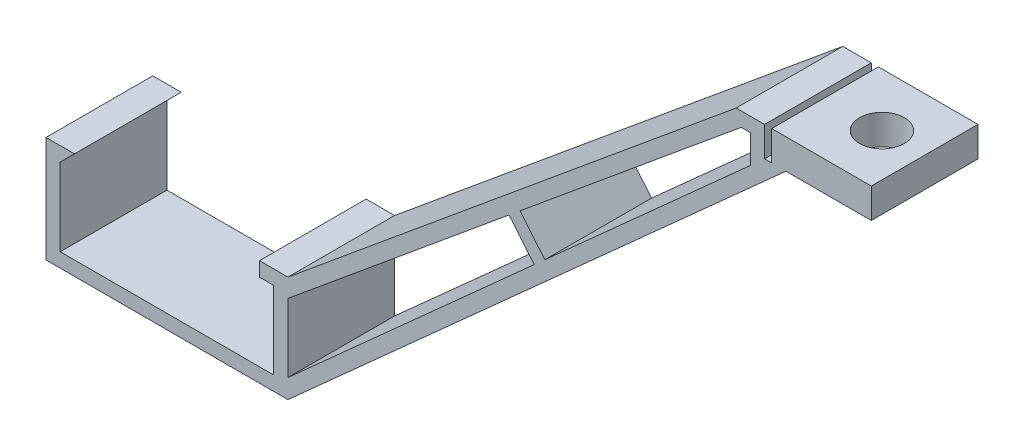
ISO-10303-21;
HEADER;
FILE_DESCRIPTION(('STEP AP214'),'2;1');
FILE_NAME('part.step','',(''),(''),'','','');
FILE_SCHEMA(('AUTOMOTIVE_DESIGN { 1 0 10303 214 1 1 1 1 }'));
ENDSEC;
DATA;
#1=APPLICATION_CONTEXT('core data for automotive mechanical design processes');
#2=APPLICATION_PROTOCOL_DEFINITION('international standard','automotive_design',2000,#1);
#3=PRODUCT_CONTEXT('',#1,'mechanical');
#4=PRODUCT('Part','Part','',(#3));
#5=PRODUCT_RELATED_PRODUCT_CATEGORY('part','',(#4));
#6=PRODUCT_DEFINITION_FORMATION('','',#4);
#7=PRODUCT_DEFINITION_CONTEXT('part definition',#1,'design');
#8=PRODUCT_DEFINITION('design','',#6,#7);
#9=PRODUCT_DEFINITION_SHAPE('','',#8);
#10=(LENGTH_UNIT() NAMED_UNIT(*) SI_UNIT(.MILLI.,.METRE.));
#11=(NAMED_UNIT(*) PLANE_ANGLE_UNIT() SI_UNIT($,.RADIAN.));
#12=(NAMED_UNIT(*) SI_UNIT($,.STERADIAN.) SOLID_ANGLE_UNIT());
#13=UNCERTAINTY_MEASURE_WITH_UNIT(LENGTH_MEASURE(1.E-05),#10,'distance_accuracy_value','');
#14=(GEOMETRIC_REPRESENTATION_CONTEXT(3) GLOBAL_UNCERTAINTY_ASSIGNED_CONTEXT((#13)) GLOBAL_UNIT_ASSIGNED_CONTEXT((#10,
#11,#12)) REPRESENTATION_CONTEXT('',''));
#15=CARTESIAN_POINT('',(0.,0.,0.));
#16=DIRECTION('',(0.,0.,1.));
#17=DIRECTION('',(1.,0.,0.));
#18=AXIS2_PLACEMENT_3D('',#15,#16,#17);
#19=CARTESIAN_POINT('',(15.,-15.,15.));
#20=DIRECTION('',(0.,-1.,0.));
#21=DIRECTION('',(1.,0.,0.));
#22=AXIS2_PLACEMENT_3D('',#19,#20,#21);
#23=PLANE('',#22);
#24=DIRECTION('',(-1.,0.,0.));
#25=VECTOR('',#24,1.);
#26=CARTESIAN_POINT('',(15.,-15.,0.));
#27=LINE('',#26,#25);
#28=CARTESIAN_POINT('',(15.,-15.,0.));
#29=VERTEX_POINT('',#28);
#30=CARTESIAN_POINT('',(-15.,-15.,0.));
#31=VERTEX_POINT('',#30);
#32=EDGE_CURVE('E271',#29,#31,#27,.T.);
#33=ORIENTED_EDGE('',*,*,#32,.T.);
#34=DIRECTION('',(0.,0.,-1.));
#35=VECTOR('',#34,1.);
#36=CARTESIAN_POINT('',(-15.,-15.,15.));
#37=LINE('',#36,#35);
#38=CARTESIAN_POINT('',(-15.,-15.,15.));
#39=VERTEX_POINT('',#38);
#40=EDGE_CURVE('E11',#39,#31,#37,.T.);
#41=ORIENTED_EDGE('',*,*,#40,.F.);
#42=DIRECTION('',(-1.,0.,0.));
#43=VECTOR('',#42,1.);
#44=CARTESIAN_POINT('',(15.,-15.,15.));
#45=LINE('',#44,#43);
#46=CARTESIAN_POINT('',(15.,-15.,15.));
#47=VERTEX_POINT('',#46);
#48=EDGE_CURVE('E360',#47,#39,#45,.T.);
#49=ORIENTED_EDGE('',*,*,#48,.F.);
#50=DIRECTION('',(0.,0.,-1.));
#51=VECTOR('',#50,1.);
#52=CARTESIAN_POINT('',(15.,-15.,15.));
#53=LINE('',#52,#51);
#54=EDGE_CURVE('E383',#47,#29,#53,.T.);
#55=ORIENTED_EDGE('',*,*,#54,.T.);
#56=EDGE_LOOP('',(#33,#41,#49,#55));
#57=FACE_BOUND('',#56,.T.);
#58=ADVANCED_FACE('F32',(#57),#23,.F.);
#59=CARTESIAN_POINT('',(-15.,-15.,15.));
#60=DIRECTION('',(-1.,0.,0.));
#61=DIRECTION('',(0.,0.,1.));
#62=AXIS2_PLACEMENT_3D('',#59,#60,#61);
#63=PLANE('',#62);
#64=DIRECTION('',(0.,1.,0.));
#65=VECTOR('',#64,1.);
#66=CARTESIAN_POINT('',(-15.,-15.,0.));
#67=LINE('',#66,#65);
#68=CARTESIAN_POINT('',(-15.,-4.08500000000001,0.));
#69=VERTEX_POINT('',#68);
#70=EDGE_CURVE('E386',#31,#69,#67,.T.);
#71=ORIENTED_EDGE('',*,*,#70,.T.);
#72=DIRECTION('',(0.,0.,-1.));
#73=VECTOR('',#72,1.);
#74=CARTESIAN_POINT('',(-15.,-4.08500000000001,15.));
#75=LINE('',#74,#73);
#76=CARTESIAN_POINT('',(-15.,-4.08500000000001,15.));
#77=VERTEX_POINT('',#76);
#78=EDGE_CURVE('E39',#77,#69,#75,.T.);
#79=ORIENTED_EDGE('',*,*,#78,.F.);
#80=DIRECTION('',(0.,1.,0.));
#81=VECTOR('',#80,1.);
#82=CARTESIAN_POINT('',(-15.,-15.,15.));
#83=LINE('',#82,#81);
#84=EDGE_CURVE('E363',#39,#77,#83,.T.);
#85=ORIENTED_EDGE('',*,*,#84,.F.);
#86=ORIENTED_EDGE('',*,*,#40,.T.);
#87=EDGE_LOOP('',(#71,#79,#85,#86));
#88=FACE_BOUND('',#87,.T.);
#89=ADVANCED_FACE('F456',(#88),#63,.F.);
#90=CARTESIAN_POINT('',(-15.,-4.08500000000001,15.));
#91=DIRECTION('',(-0.707106781186548,0.707106781186547,0.));
#92=DIRECTION('',(-0.707106781186547,-0.707106781186548,0.));
#93=AXIS2_PLACEMENT_3D('',#90,#91,#92);
#94=PLANE('',#93);
#95=DIRECTION('',(0.707106781186547,0.707106781186548,0.));
#96=VECTOR('',#95,1.);
#97=CARTESIAN_POINT('',(-15.,-4.08500000000001,0.));
#98=LINE('',#97,#96);
#99=CARTESIAN_POINT('',(-13.,-2.085,0.));
#100=VERTEX_POINT('',#99);
#101=EDGE_CURVE('E388',#69,#100,#98,.T.);
#102=ORIENTED_EDGE('',*,*,#101,.T.);
#103=DIRECTION('',(0.,0.,-1.));
#104=VECTOR('',#103,1.);
#105=CARTESIAN_POINT('',(-13.,-2.085,15.));
#106=LINE('',#105,#104);
#107=CARTESIAN_POINT('',(-13.,-2.085,15.));
#108=VERTEX_POINT('',#107);
#109=EDGE_CURVE('E428',#108,#100,#106,.T.);
#110=ORIENTED_EDGE('',*,*,#109,.F.);
#111=DIRECTION('',(0.707106781186547,0.707106781186548,0.));
#112=VECTOR('',#111,1.);
#113=CARTESIAN_POINT('',(-15.,-4.08500000000001,15.));
#114=LINE('',#113,#112);
#115=EDGE_CURVE('E366',#77,#108,#114,.T.);
#116=ORIENTED_EDGE('',*,*,#115,.F.);
#117=ORIENTED_EDGE('',*,*,#78,.T.);
#118=EDGE_LOOP('',(#102,#110,#116,#117));
#119=FACE_BOUND('',#118,.T.);
#120=ADVANCED_FACE('F435',(#119),#94,.F.);
#121=CARTESIAN_POINT('',(-17.,-2.085,15.));
#122=DIRECTION('',(0.,-1.,0.));
#123=DIRECTION('',(1.,0.,0.));
#124=AXIS2_PLACEMENT_3D('',#121,#122,#123);
#125=PLANE('',#124);
#126=DIRECTION('',(-1.,0.,0.));
#127=VECTOR('',#126,1.);
#128=CARTESIAN_POINT('',(-17.,-2.085,0.));
#129=LINE('',#128,#127);
#130=CARTESIAN_POINT('',(-17.,-2.085,0.));
#131=VERTEX_POINT('',#130);
#132=EDGE_CURVE('E390',#100,#131,#129,.T.);
#133=ORIENTED_EDGE('',*,*,#132,.T.);
#134=DIRECTION('',(0.,0.,-1.));
#135=VECTOR('',#134,1.);
#136=CARTESIAN_POINT('',(-17.,-2.085,15.));
#137=LINE('',#136,#135);
#138=CARTESIAN_POINT('',(-17.,-2.085,15.));
#139=VERTEX_POINT('',#138);
#140=EDGE_CURVE('E425',#139,#131,#137,.T.);
#141=ORIENTED_EDGE('',*,*,#140,.F.);
#142=DIRECTION('',(-1.,0.,0.));
#143=VECTOR('',#142,1.);
#144=CARTESIAN_POINT('',(-17.,-2.085,15.));
#145=LINE('',#144,#143);
#146=EDGE_CURVE('E368',#108,#139,#145,.T.);
#147=ORIENTED_EDGE('',*,*,#146,.F.);
#148=ORIENTED_EDGE('',*,*,#109,.T.);
#149=EDGE_LOOP('',(#133,#141,#147,#148));
#150=FACE_BOUND('',#149,.T.);
#151=ADVANCED_FACE('F443',(#150),#125,.F.);
#152=CARTESIAN_POINT('',(-17.,-17.,15.));
#153=DIRECTION('',(1.,0.,0.));
#154=DIRECTION('',(0.,0.,-1.));
#155=AXIS2_PLACEMENT_3D('',#152,#153,#154);
#156=PLANE('',#155);
#157=DIRECTION('',(0.,-1.,0.));
#158=VECTOR('',#157,1.);
#159=CARTESIAN_POINT('',(-17.,-17.,0.));
#160=LINE('',#159,#158);
#161=CARTESIAN_POINT('',(-17.,-17.,0.));
#162=VERTEX_POINT('',#161);
#163=EDGE_CURVE('E392',#131,#162,#160,.T.);
#164=ORIENTED_EDGE('',*,*,#163,.T.);
#165=DIRECTION('',(0.,0.,-1.));
#166=VECTOR('',#165,1.);
#167=CARTESIAN_POINT('',(-17.,-17.,15.));
#168=LINE('',#167,#166);
#169=CARTESIAN_POINT('',(-17.,-17.,15.));
#170=VERTEX_POINT('',#169);
#171=EDGE_CURVE('E422',#170,#162,#168,.T.);
#172=ORIENTED_EDGE('',*,*,#171,.F.);
#173=DIRECTION('',(0.,-1.,0.));
#174=VECTOR('',#173,1.);
#175=CARTESIAN_POINT('',(-17.,-17.,15.));
#176=LINE('',#175,#174);
#177=EDGE_CURVE('E370',#139,#170,#176,.T.);
#178=ORIENTED_EDGE('',*,*,#177,.F.);
#179=ORIENTED_EDGE('',*,*,#140,.T.);
#180=EDGE_LOOP('',(#164,#172,#178,#179));
#181=FACE_BOUND('',#180,.T.);
#182=ADVANCED_FACE('F447',(#181),#156,.F.);
#183=CARTESIAN_POINT('',(17.,-17.,15.));
#184=DIRECTION('',(0.,1.,0.));
#185=DIRECTION('',(-1.,0.,0.));
#186=AXIS2_PLACEMENT_3D('',#183,#184,#185);
#187=PLANE('',#186);
#188=DIRECTION('',(1.,0.,0.));
#189=VECTOR('',#188,1.);
#190=CARTESIAN_POINT('',(17.,-17.,0.));
#191=LINE('',#190,#189);
#192=CARTESIAN_POINT('',(17.,-17.,0.));
#193=VERTEX_POINT('',#192);
#194=EDGE_CURVE('E394',#162,#193,#191,.T.);
#195=ORIENTED_EDGE('',*,*,#194,.T.);
#196=DIRECTION('',(0.,0.,-1.));
#197=VECTOR('',#196,1.);
#198=CARTESIAN_POINT('',(17.,-17.,15.));
#199=LINE('',#198,#197);
#200=CARTESIAN_POINT('',(17.,-17.,15.));
#201=VERTEX_POINT('',#200);
#202=EDGE_CURVE('E419',#201,#193,#199,.T.);
#203=ORIENTED_EDGE('',*,*,#202,.F.);
#204=DIRECTION('',(1.,0.,0.));
#205=VECTOR('',#204,1.);
#206=CARTESIAN_POINT('',(17.,-17.,15.));
#207=LINE('',#206,#205);
#208=EDGE_CURVE('E372',#170,#201,#207,.T.);
#209=ORIENTED_EDGE('',*,*,#208,.F.);
#210=ORIENTED_EDGE('',*,*,#171,.T.);
#211=EDGE_LOOP('',(#195,#203,#209,#210));
#212=FACE_BOUND('',#211,.T.);
#213=ADVANCED_FACE('F537',(#212),#187,.F.);
#214=CARTESIAN_POINT('',(17.,-17.,15.));
#215=DIRECTION('',(-1.,0.,0.));
#216=DIRECTION('',(0.,0.,1.));
#217=AXIS2_PLACEMENT_3D('',#214,#215,#216);
#218=PLANE('',#217);
#219=DIRECTION('',(0.,1.,0.));
#220=VECTOR('',#219,1.);
#221=CARTESIAN_POINT('',(17.,-17.,15.));
#222=LINE('',#221,#220);
#223=CARTESIAN_POINT('',(17.,-14.3130944891028,15.));
#224=VERTEX_POINT('',#223);
#225=CARTESIAN_POINT('',(17.,-4.68000212023637,15.));
#226=VERTEX_POINT('',#225);
#227=EDGE_CURVE('E50',#224,#226,#222,.T.);
#228=ORIENTED_EDGE('',*,*,#227,.F.);
#229=DIRECTION('',(0.,0.,-1.));
#230=VECTOR('',#229,1.);
#231=CARTESIAN_POINT('',(17.,-14.3130944891028,111.896852374058));
#232=LINE('',#231,#230);
#233=CARTESIAN_POINT('',(17.,-14.3130944891028,0.));
#234=VERTEX_POINT('',#233);
#235=EDGE_CURVE('E347',#224,#234,#232,.T.);
#236=ORIENTED_EDGE('',*,*,#235,.T.);
#237=DIRECTION('',(0.,1.,0.));
#238=VECTOR('',#237,1.);
#239=CARTESIAN_POINT('',(17.,-17.,0.));
#240=LINE('',#239,#238);
#241=CARTESIAN_POINT('',(17.,-4.68000212023637,0.));
#242=VERTEX_POINT('',#241);
#243=EDGE_CURVE('E396',#234,#242,#240,.T.);
#244=ORIENTED_EDGE('',*,*,#243,.T.);
#245=DIRECTION('',(0.,0.,-1.));
#246=VECTOR('',#245,1.);
#247=CARTESIAN_POINT('',(17.,-4.68000212023637,111.896852374058));
#248=LINE('',#247,#246);
#249=EDGE_CURVE('E46',#226,#242,#248,.T.);
#250=ORIENTED_EDGE('',*,*,#249,.F.);
#251=EDGE_LOOP('',(#228,#236,#244,#250));
#252=FACE_BOUND('',#251,.T.);
#253=ADVANCED_FACE('F540',(#252),#218,.F.);
#254=CARTESIAN_POINT('',(17.,-2.085,15.));
#255=DIRECTION('',(0.,-1.,0.));
#256=DIRECTION('',(0.,0.,-1.));
#257=AXIS2_PLACEMENT_3D('',#254,#255,#256);
#258=PLANE('',#257);
#259=DIRECTION('',(-1.,0.,0.));
#260=VECTOR('',#259,1.);
#261=CARTESIAN_POINT('',(17.,-2.085,0.));
#262=LINE('',#261,#260);
#263=CARTESIAN_POINT('',(17.,-2.085,0.));
#264=VERTEX_POINT('',#263);
#265=CARTESIAN_POINT('',(13.,-2.085,0.));
#266=VERTEX_POINT('',#265);
#267=EDGE_CURVE('E398',#264,#266,#262,.T.);
#268=ORIENTED_EDGE('',*,*,#267,.T.);
#269=DIRECTION('',(0.,0.,-1.));
#270=VECTOR('',#269,1.);
#271=CARTESIAN_POINT('',(13.,-2.085,15.));
#272=LINE('',#271,#270);
#273=CARTESIAN_POINT('',(13.,-2.085,15.));
#274=VERTEX_POINT('',#273);
#275=EDGE_CURVE('E413',#274,#266,#272,.T.);
#276=ORIENTED_EDGE('',*,*,#275,.F.);
#277=DIRECTION('',(-1.,0.,0.));
#278=VECTOR('',#277,1.);
#279=CARTESIAN_POINT('',(17.,-2.085,15.));
#280=LINE('',#279,#278);
#281=CARTESIAN_POINT('',(17.,-2.085,15.));
#282=VERTEX_POINT('',#281);
#283=EDGE_CURVE('E375',#282,#274,#280,.T.);
#284=ORIENTED_EDGE('',*,*,#283,.F.);
#285=DIRECTION('',(0.,0.,-1.));
#286=VECTOR('',#285,1.);
#287=CARTESIAN_POINT('',(17.,-2.085,15.));
#288=LINE('',#287,#286);
#289=EDGE_CURVE('E416',#282,#264,#288,.T.);
#290=ORIENTED_EDGE('',*,*,#289,.T.);
#291=EDGE_LOOP('',(#268,#276,#284,#290));
#292=FACE_BOUND('',#291,.T.);
#293=ADVANCED_FACE('F477',(#292),#258,.F.);
#294=CARTESIAN_POINT('',(13.,-2.085,15.));
#295=DIRECTION('',(1.,0.,0.));
#296=DIRECTION('',(0.,0.,-1.));
#297=AXIS2_PLACEMENT_3D('',#294,#295,#296);
#298=PLANE('',#297);
#299=DIRECTION('',(0.,-1.,0.));
#300=VECTOR('',#299,1.);
#301=CARTESIAN_POINT('',(13.,-2.085,0.));
#302=LINE('',#301,#300);
#303=CARTESIAN_POINT('',(13.,-4.085,0.));
#304=VERTEX_POINT('',#303);
#305=EDGE_CURVE('E400',#266,#304,#302,.T.);
#306=ORIENTED_EDGE('',*,*,#305,.T.);
#307=DIRECTION('',(0.,0.,-1.));
#308=VECTOR('',#307,1.);
#309=CARTESIAN_POINT('',(13.,-4.085,15.));
#310=LINE('',#309,#308);
#311=CARTESIAN_POINT('',(13.,-4.085,15.));
#312=VERTEX_POINT('',#311);
#313=EDGE_CURVE('E410',#312,#304,#310,.T.);
#314=ORIENTED_EDGE('',*,*,#313,.F.);
#315=DIRECTION('',(0.,-1.,0.));
#316=VECTOR('',#315,1.);
#317=CARTESIAN_POINT('',(13.,-2.085,15.));
#318=LINE('',#317,#316);
#319=EDGE_CURVE('E377',#274,#312,#318,.T.);
#320=ORIENTED_EDGE('',*,*,#319,.F.);
#321=ORIENTED_EDGE('',*,*,#275,.T.);
#322=EDGE_LOOP('',(#306,#314,#320,#321));
#323=FACE_BOUND('',#322,.T.);
#324=ADVANCED_FACE('F472',(#323),#298,.F.);
#325=CARTESIAN_POINT('',(15.,-4.085,15.));
#326=DIRECTION('',(0.,1.,0.));
#327=DIRECTION('',(0.,0.,1.));
#328=AXIS2_PLACEMENT_3D('',#325,#326,#327);
#329=PLANE('',#328);
#330=DIRECTION('',(1.,0.,0.));
#331=VECTOR('',#330,1.);
#332=CARTESIAN_POINT('',(15.,-4.085,0.));
#333=LINE('',#332,#331);
#334=CARTESIAN_POINT('',(15.,-4.085,0.));
#335=VERTEX_POINT('',#334);
#336=EDGE_CURVE('E402',#304,#335,#333,.T.);
#337=ORIENTED_EDGE('',*,*,#336,.T.);
#338=DIRECTION('',(0.,0.,-1.));
#339=VECTOR('',#338,1.);
#340=CARTESIAN_POINT('',(15.,-4.085,15.));
#341=LINE('',#340,#339);
#342=CARTESIAN_POINT('',(15.,-4.085,15.));
#343=VERTEX_POINT('',#342);
#344=EDGE_CURVE('E407',#343,#335,#341,.T.);
#345=ORIENTED_EDGE('',*,*,#344,.F.);
#346=DIRECTION('',(1.,0.,0.));
#347=VECTOR('',#346,1.);
#348=CARTESIAN_POINT('',(15.,-4.085,15.));
#349=LINE('',#348,#347);
#350=EDGE_CURVE('E379',#312,#343,#349,.T.);
#351=ORIENTED_EDGE('',*,*,#350,.F.);
#352=ORIENTED_EDGE('',*,*,#313,.T.);
#353=EDGE_LOOP('',(#337,#345,#351,#352));
#354=FACE_BOUND('',#353,.T.);
#355=ADVANCED_FACE('F468',(#354),#329,.F.);
#356=CARTESIAN_POINT('',(15.,-15.,15.));
#357=DIRECTION('',(1.,0.,0.));
#358=DIRECTION('',(0.,1.,0.));
#359=AXIS2_PLACEMENT_3D('',#356,#357,#358);
#360=PLANE('',#359);
#361=DIRECTION('',(0.,-1.,0.));
#362=VECTOR('',#361,1.);
#363=CARTESIAN_POINT('',(15.,-15.,0.));
#364=LINE('',#363,#362);
#365=EDGE_CURVE('E364',#335,#29,#364,.T.);
#366=ORIENTED_EDGE('',*,*,#365,.T.);
#367=ORIENTED_EDGE('',*,*,#54,.F.);
#368=DIRECTION('',(0.,-1.,0.));
#369=VECTOR('',#368,1.);
#370=CARTESIAN_POINT('',(15.,-15.,15.));
#371=LINE('',#370,#369);
#372=EDGE_CURVE('E381',#343,#47,#371,.T.);
#373=ORIENTED_EDGE('',*,*,#372,.F.);
#374=ORIENTED_EDGE('',*,*,#344,.T.);
#375=EDGE_LOOP('',(#366,#367,#373,#374));
#376=FACE_BOUND('',#375,.T.);
#377=ADVANCED_FACE('F463',(#376),#360,.F.);
#378=CARTESIAN_POINT('',(0.,0.,15.));
#379=DIRECTION('',(0.,0.,-1.));
#380=DIRECTION('',(-1.,0.,0.));
#381=AXIS2_PLACEMENT_3D('',#378,#379,#380);
#382=PLANE('',#381);
#383=DIRECTION('',(-0.744350700792661,-0.667788914425416,0.));
#384=VECTOR('',#383,1.);
#385=CARTESIAN_POINT('',(51.6228598832431,16.7485569490067,15.));
#386=LINE('',#385,#384);
#387=CARTESIAN_POINT('',(51.6228598832431,16.7485569490067,15.));
#388=VERTEX_POINT('',#387);
#389=EDGE_CURVE('E281',#388,#224,#386,.T.);
#390=ORIENTED_EDGE('',*,*,#389,.T.);
#391=ORIENTED_EDGE('',*,*,#227,.T.);
#392=DIRECTION('',(0.770712279733255,0.637183318887406,0.));
#393=VECTOR('',#392,1.);
#394=CARTESIAN_POINT('',(48.0891334875211,21.0228156209944,15.));
#395=LINE('',#394,#393);
#396=CARTESIAN_POINT('',(48.0891334875211,21.0228156209944,15.));
#397=VERTEX_POINT('',#396);
#398=EDGE_CURVE('E285',#226,#397,#395,.T.);
#399=ORIENTED_EDGE('',*,*,#398,.T.);
#400=DIRECTION('',(0.637183318887406,-0.770712279733255,0.));
#401=VECTOR('',#400,1.);
#402=CARTESIAN_POINT('',(48.0891334875211,21.0228156209944,15.));
#403=LINE('',#402,#401);
#404=EDGE_CURVE('E283',#397,#388,#403,.T.);
#405=ORIENTED_EDGE('',*,*,#404,.T.);
#406=EDGE_LOOP('',(#390,#391,#399,#405));
#407=FACE_BOUND('',#406,.T.);
#408=ORIENTED_EDGE('',*,*,#48,.T.);
#409=ORIENTED_EDGE('',*,*,#84,.T.);
#410=ORIENTED_EDGE('',*,*,#115,.T.);
#411=ORIENTED_EDGE('',*,*,#146,.T.);
#412=ORIENTED_EDGE('',*,*,#177,.T.);
#413=ORIENTED_EDGE('',*,*,#208,.T.);
#414=DIRECTION('',(0.744350700792661,0.667788914425416,0.));
#415=VECTOR('',#414,1.);
#416=CARTESIAN_POINT('',(87.,45.8,15.));
#417=LINE('',#416,#415);
#418=CARTESIAN_POINT('',(87.,45.8,15.));
#419=VERTEX_POINT('',#418);
#420=EDGE_CURVE('E278',#201,#419,#417,.T.);
#421=ORIENTED_EDGE('',*,*,#420,.T.);
#422=DIRECTION('',(1.,0.,0.));
#423=VECTOR('',#422,1.);
#424=CARTESIAN_POINT('',(87.,45.8,15.));
#425=LINE('',#424,#423);
#426=CARTESIAN_POINT('',(99.,45.8,15.));
#427=VERTEX_POINT('',#426);
#428=EDGE_CURVE('E251',#419,#427,#425,.T.);
#429=ORIENTED_EDGE('',*,*,#428,.T.);
#430=DIRECTION('',(0.,1.,0.));
#431=VECTOR('',#430,1.);
#432=CARTESIAN_POINT('',(99.,50.,15.));
#433=LINE('',#432,#431);
#434=CARTESIAN_POINT('',(99.,50.,15.));
#435=VERTEX_POINT('',#434);
#436=EDGE_CURVE('E254',#427,#435,#433,.T.);
#437=ORIENTED_EDGE('',*,*,#436,.T.);
#438=DIRECTION('',(-1.,0.,0.));
#439=VECTOR('',#438,1.);
#440=CARTESIAN_POINT('',(85.,50.,15.));
#441=LINE('',#440,#439);
#442=CARTESIAN_POINT('',(85.,50.,15.));
#443=VERTEX_POINT('',#442);
#444=EDGE_CURVE('E235',#435,#443,#441,.T.);
#445=ORIENTED_EDGE('',*,*,#444,.T.);
#446=DIRECTION('',(0.,-1.,0.));
#447=VECTOR('',#446,1.);
#448=CARTESIAN_POINT('',(85.,50.,15.));
#449=LINE('',#448,#447);
#450=CARTESIAN_POINT('',(85.,45.8,15.));
#451=VERTEX_POINT('',#450);
#452=EDGE_CURVE('E274',#443,#451,#449,.T.);
#453=ORIENTED_EDGE('',*,*,#452,.T.);
#454=DIRECTION('',(-1.,0.,0.));
#455=VECTOR('',#454,1.);
#456=CARTESIAN_POINT('',(85.,45.8,15.));
#457=LINE('',#456,#455);
#458=CARTESIAN_POINT('',(84.,45.8,15.));
#459=VERTEX_POINT('',#458);
#460=EDGE_CURVE('E272',#451,#459,#457,.T.);
#461=ORIENTED_EDGE('',*,*,#460,.T.);
#462=DIRECTION('',(0.,1.,0.));
#463=VECTOR('',#462,1.);
#464=CARTESIAN_POINT('',(84.,45.8,15.));
#465=LINE('',#464,#463);
#466=CARTESIAN_POINT('',(83.9999999999999,50.,15.));
#467=VERTEX_POINT('',#466);
#468=EDGE_CURVE('E259',#459,#467,#465,.T.);
#469=ORIENTED_EDGE('',*,*,#468,.T.);
#470=DIRECTION('',(-1.,0.,0.));
#471=VECTOR('',#470,1.);
#472=CARTESIAN_POINT('',(80.,50.,15.));
#473=LINE('',#472,#471);
#474=CARTESIAN_POINT('',(80.,50.,15.));
#475=VERTEX_POINT('',#474);
#476=EDGE_CURVE('E269',#467,#475,#473,.T.);
#477=ORIENTED_EDGE('',*,*,#476,.T.);
#478=DIRECTION('',(-0.770712279733255,-0.637183318887406,0.));
#479=VECTOR('',#478,1.);
#480=CARTESIAN_POINT('',(80.,50.,15.));
#481=LINE('',#480,#479);
#482=EDGE_CURVE('E287',#475,#282,#481,.T.);
#483=ORIENTED_EDGE('',*,*,#482,.T.);
#484=ORIENTED_EDGE('',*,*,#283,.T.);
#485=ORIENTED_EDGE('',*,*,#319,.T.);
#486=ORIENTED_EDGE('',*,*,#350,.T.);
#487=ORIENTED_EDGE('',*,*,#372,.T.);
#488=EDGE_LOOP('',(#408,#409,#410,#411,#412,#413,#421,#429,#437,#445,#453,#461,#469,#477,#483,
#484,#485,#486,#487));
#489=FACE_BOUND('',#488,.T.);
#490=DIRECTION('',(0.,1.,0.));
#491=VECTOR('',#490,1.);
#492=CARTESIAN_POINT('',(82.,48.,15.));
#493=LINE('',#492,#491);
#494=CARTESIAN_POINT('',(82.,44.0011912251829,15.));
#495=VERTEX_POINT('',#494);
#496=CARTESIAN_POINT('',(82.,48.,15.));
#497=VERTEX_POINT('',#496);
#498=EDGE_CURVE('E275',#495,#497,#493,.T.);
#499=ORIENTED_EDGE('',*,*,#498,.F.);
#500=DIRECTION('',(0.744350700792661,0.667788914425416,0.));
#501=VECTOR('',#500,1.);
#502=CARTESIAN_POINT('',(82.,44.0011912251829,15.));
#503=LINE('',#502,#501);
#504=CARTESIAN_POINT('',(53.1127767853509,18.0852252554692,15.));
#505=VERTEX_POINT('',#504);
#506=EDGE_CURVE('E256',#505,#495,#503,.T.);
#507=ORIENTED_EDGE('',*,*,#506,.F.);
#508=DIRECTION('',(0.637183318887406,-0.770712279733254,0.));
#509=VECTOR('',#508,1.);
#510=CARTESIAN_POINT('',(49.6305580469877,22.2971822587692,15.));
#511=LINE('',#510,#509);
#512=CARTESIAN_POINT('',(49.6305580469877,22.2971822587692,15.));
#513=VERTEX_POINT('',#512);
#514=EDGE_CURVE('E260',#513,#505,#511,.T.);
#515=ORIENTED_EDGE('',*,*,#514,.F.);
#516=DIRECTION('',(-0.770712279733255,-0.637183318887406,0.));
#517=VECTOR('',#516,1.);
#518=CARTESIAN_POINT('',(80.7196915345088,48.,15.));
#519=LINE('',#518,#517);
#520=CARTESIAN_POINT('',(80.7196915345088,48.,15.));
#521=VERTEX_POINT('',#520);
#522=EDGE_CURVE('E263',#521,#513,#519,.T.);
#523=ORIENTED_EDGE('',*,*,#522,.F.);
#524=DIRECTION('',(-1.,0.,0.));
#525=VECTOR('',#524,1.);
#526=CARTESIAN_POINT('',(80.7196915345088,48.,15.));
#527=LINE('',#526,#525);
#528=EDGE_CURVE('E266',#497,#521,#527,.T.);
#529=ORIENTED_EDGE('',*,*,#528,.F.);
#530=EDGE_LOOP('',(#499,#507,#515,#523,#529));
#531=FACE_BOUND('',#530,.T.);
#532=ADVANCED_FACE('F451',(#407,#489,#531),#382,.F.);
#533=CARTESIAN_POINT('',(0.,0.,0.));
#534=DIRECTION('',(0.,0.,-1.));
#535=DIRECTION('',(-1.,0.,0.));
#536=AXIS2_PLACEMENT_3D('',#533,#534,#535);
#537=PLANE('',#536);
#538=ORIENTED_EDGE('',*,*,#243,.F.);
#539=DIRECTION('',(0.744350700792661,0.667788914425416,0.));
#540=VECTOR('',#539,1.);
#541=CARTESIAN_POINT('',(51.6228598832431,16.7485569490067,0.));
#542=LINE('',#541,#540);
#543=CARTESIAN_POINT('',(51.6228598832431,16.7485569490067,0.));
#544=VERTEX_POINT('',#543);
#545=EDGE_CURVE('E327',#234,#544,#542,.T.);
#546=ORIENTED_EDGE('',*,*,#545,.T.);
#547=DIRECTION('',(-0.637183318887406,0.770712279733255,0.));
#548=VECTOR('',#547,1.);
#549=CARTESIAN_POINT('',(48.0891334875211,21.0228156209944,0.));
#550=LINE('',#549,#548);
#551=CARTESIAN_POINT('',(48.0891334875211,21.0228156209944,0.));
#552=VERTEX_POINT('',#551);
#553=EDGE_CURVE('E330',#544,#552,#550,.T.);
#554=ORIENTED_EDGE('',*,*,#553,.T.);
#555=DIRECTION('',(-0.770712279733255,-0.637183318887406,0.));
#556=VECTOR('',#555,1.);
#557=CARTESIAN_POINT('',(48.0891334875211,21.0228156209944,0.));
#558=LINE('',#557,#556);
#559=EDGE_CURVE('E333',#552,#242,#558,.T.);
#560=ORIENTED_EDGE('',*,*,#559,.T.);
#561=EDGE_LOOP('',(#538,#546,#554,#560));
#562=FACE_BOUND('',#561,.T.);
#563=ORIENTED_EDGE('',*,*,#32,.F.);
#564=ORIENTED_EDGE('',*,*,#365,.F.);
#565=ORIENTED_EDGE('',*,*,#336,.F.);
#566=ORIENTED_EDGE('',*,*,#305,.F.);
#567=ORIENTED_EDGE('',*,*,#267,.F.);
#568=DIRECTION('',(0.770712279733255,0.637183318887406,0.));
#569=VECTOR('',#568,1.);
#570=CARTESIAN_POINT('',(80.,50.,0.));
#571=LINE('',#570,#569);
#572=CARTESIAN_POINT('',(80.,50.,0.));
#573=VERTEX_POINT('',#572);
#574=EDGE_CURVE('E336',#264,#573,#571,.T.);
#575=ORIENTED_EDGE('',*,*,#574,.T.);
#576=DIRECTION('',(1.,0.,0.));
#577=VECTOR('',#576,1.);
#578=CARTESIAN_POINT('',(80.,50.,0.));
#579=LINE('',#578,#577);
#580=CARTESIAN_POINT('',(83.9999999999999,50.,0.));
#581=VERTEX_POINT('',#580);
#582=EDGE_CURVE('E309',#573,#581,#579,.T.);
#583=ORIENTED_EDGE('',*,*,#582,.T.);
#584=DIRECTION('',(0.,-1.,0.));
#585=VECTOR('',#584,1.);
#586=CARTESIAN_POINT('',(84.,45.8,0.));
#587=LINE('',#586,#585);
#588=CARTESIAN_POINT('',(84.,45.8,0.));
#589=VERTEX_POINT('',#588);
#590=EDGE_CURVE('E319',#581,#589,#587,.T.);
#591=ORIENTED_EDGE('',*,*,#590,.T.);
#592=DIRECTION('',(1.,0.,0.));
#593=VECTOR('',#592,1.);
#594=CARTESIAN_POINT('',(85.,45.8,0.));
#595=LINE('',#594,#593);
#596=CARTESIAN_POINT('',(85.,45.8,0.));
#597=VERTEX_POINT('',#596);
#598=EDGE_CURVE('E322',#589,#597,#595,.T.);
#599=ORIENTED_EDGE('',*,*,#598,.T.);
#600=DIRECTION('',(0.,1.,0.));
#601=VECTOR('',#600,1.);
#602=CARTESIAN_POINT('',(85.,50.,0.));
#603=LINE('',#602,#601);
#604=CARTESIAN_POINT('',(85.,50.,0.));
#605=VERTEX_POINT('',#604);
#606=EDGE_CURVE('E227',#597,#605,#603,.T.);
#607=ORIENTED_EDGE('',*,*,#606,.T.);
#608=DIRECTION('',(1.,0.,0.));
#609=VECTOR('',#608,1.);
#610=CARTESIAN_POINT('',(85.,50.,0.));
#611=LINE('',#610,#609);
#612=CARTESIAN_POINT('',(99.,50.,0.));
#613=VERTEX_POINT('',#612);
#614=EDGE_CURVE('E216',#605,#613,#611,.T.);
#615=ORIENTED_EDGE('',*,*,#614,.T.);
#616=DIRECTION('',(0.,-1.,0.));
#617=VECTOR('',#616,1.);
#618=CARTESIAN_POINT('',(99.,50.,0.));
#619=LINE('',#618,#617);
#620=CARTESIAN_POINT('',(99.,45.8,0.));
#621=VERTEX_POINT('',#620);
#622=EDGE_CURVE('E223',#613,#621,#619,.T.);
#623=ORIENTED_EDGE('',*,*,#622,.T.);
#624=DIRECTION('',(-1.,0.,0.));
#625=VECTOR('',#624,1.);
#626=CARTESIAN_POINT('',(87.,45.8,0.));
#627=LINE('',#626,#625);
#628=CARTESIAN_POINT('',(87.,45.8,0.));
#629=VERTEX_POINT('',#628);
#630=EDGE_CURVE('E240',#621,#629,#627,.T.);
#631=ORIENTED_EDGE('',*,*,#630,.T.);
#632=DIRECTION('',(-0.744350700792661,-0.667788914425416,0.));
#633=VECTOR('',#632,1.);
#634=CARTESIAN_POINT('',(87.,45.8,0.));
#635=LINE('',#634,#633);
#636=EDGE_CURVE('E230',#629,#193,#635,.T.);
#637=ORIENTED_EDGE('',*,*,#636,.T.);
#638=ORIENTED_EDGE('',*,*,#194,.F.);
#639=ORIENTED_EDGE('',*,*,#163,.F.);
#640=ORIENTED_EDGE('',*,*,#132,.F.);
#641=ORIENTED_EDGE('',*,*,#101,.F.);
#642=ORIENTED_EDGE('',*,*,#70,.F.);
#643=EDGE_LOOP('',(#563,#564,#565,#566,#567,#575,#583,#591,#599,#607,#615,#623,#631,#637,#638,
#639,#640,#641,#642));
#644=FACE_BOUND('',#643,.T.);
#645=DIRECTION('',(0.,-1.,0.));
#646=VECTOR('',#645,1.);
#647=CARTESIAN_POINT('',(82.,48.,0.));
#648=LINE('',#647,#646);
#649=CARTESIAN_POINT('',(82.,48.,0.));
#650=VERTEX_POINT('',#649);
#651=CARTESIAN_POINT('',(82.,44.0011912251829,0.));
#652=VERTEX_POINT('',#651);
#653=EDGE_CURVE('E294',#650,#652,#648,.T.);
#654=ORIENTED_EDGE('',*,*,#653,.F.);
#655=DIRECTION('',(1.,0.,0.));
#656=VECTOR('',#655,1.);
#657=CARTESIAN_POINT('',(80.7196915345088,48.,0.));
#658=LINE('',#657,#656);
#659=CARTESIAN_POINT('',(80.7196915345088,48.,0.));
#660=VERTEX_POINT('',#659);
#661=EDGE_CURVE('E291',#660,#650,#658,.T.);
#662=ORIENTED_EDGE('',*,*,#661,.F.);
#663=DIRECTION('',(0.770712279733255,0.637183318887406,0.));
#664=VECTOR('',#663,1.);
#665=CARTESIAN_POINT('',(80.7196915345088,48.,0.));
#666=LINE('',#665,#664);
#667=CARTESIAN_POINT('',(49.6305580469877,22.2971822587692,0.));
#668=VERTEX_POINT('',#667);
#669=EDGE_CURVE('E303',#668,#660,#666,.T.);
#670=ORIENTED_EDGE('',*,*,#669,.F.);
#671=DIRECTION('',(-0.637183318887406,0.770712279733254,0.));
#672=VECTOR('',#671,1.);
#673=CARTESIAN_POINT('',(49.6305580469877,22.2971822587692,0.));
#674=LINE('',#673,#672);
#675=CARTESIAN_POINT('',(53.1127767853509,18.0852252554692,0.));
#676=VERTEX_POINT('',#675);
#677=EDGE_CURVE('E300',#676,#668,#674,.T.);
#678=ORIENTED_EDGE('',*,*,#677,.F.);
#679=DIRECTION('',(-0.744350700792661,-0.667788914425416,0.));
#680=VECTOR('',#679,1.);
#681=CARTESIAN_POINT('',(82.,44.0011912251829,0.));
#682=LINE('',#681,#680);
#683=EDGE_CURVE('E297',#652,#676,#682,.T.);
#684=ORIENTED_EDGE('',*,*,#683,.F.);
#685=EDGE_LOOP('',(#654,#662,#670,#678,#684));
#686=FACE_BOUND('',#685,.T.);
#687=ADVANCED_FACE('F219',(#562,#644,#686),#537,.T.);
#688=CARTESIAN_POINT('',(84.,45.8,111.896852374058));
#689=DIRECTION('',(1.,0.,0.));
#690=DIRECTION('',(0.,1.,0.));
#691=AXIS2_PLACEMENT_3D('',#688,#689,#690);
#692=PLANE('',#691);
#693=ORIENTED_EDGE('',*,*,#468,.F.);
#694=DIRECTION('',(0.,0.,-1.));
#695=VECTOR('',#694,1.);
#696=CARTESIAN_POINT('',(84.,45.8,111.896852374058));
#697=LINE('',#696,#695);
#698=EDGE_CURVE('E355',#459,#589,#697,.T.);
#699=ORIENTED_EDGE('',*,*,#698,.T.);
#700=ORIENTED_EDGE('',*,*,#590,.F.);
#701=DIRECTION('',(0.,0.,-1.));
#702=VECTOR('',#701,1.);
#703=CARTESIAN_POINT('',(83.9999999999999,50.,111.896852374058));
#704=LINE('',#703,#702);
#705=EDGE_CURVE('E339',#467,#581,#704,.T.);
#706=ORIENTED_EDGE('',*,*,#705,.F.);
#707=EDGE_LOOP('',(#693,#699,#700,#706));
#708=FACE_BOUND('',#707,.T.);
#709=ADVANCED_FACE('F491',(#708),#692,.T.);
#710=CARTESIAN_POINT('',(85.,45.8,111.896852374058));
#711=DIRECTION('',(0.,1.,0.));
#712=DIRECTION('',(0.,0.,1.));
#713=AXIS2_PLACEMENT_3D('',#710,#711,#712);
#714=PLANE('',#713);
#715=ORIENTED_EDGE('',*,*,#460,.F.);
#716=DIRECTION('',(0.,0.,-1.));
#717=VECTOR('',#716,1.);
#718=CARTESIAN_POINT('',(85.,45.8,111.896852374058));
#719=LINE('',#718,#717);
#720=EDGE_CURVE('E353',#451,#597,#719,.T.);
#721=ORIENTED_EDGE('',*,*,#720,.T.);
#722=ORIENTED_EDGE('',*,*,#598,.F.);
#723=ORIENTED_EDGE('',*,*,#698,.F.);
#724=EDGE_LOOP('',(#715,#721,#722,#723));
#725=FACE_BOUND('',#724,.T.);
#726=ADVANCED_FACE('F495',(#725),#714,.T.);
#727=CARTESIAN_POINT('',(85.,50.,111.896852374058));
#728=DIRECTION('',(-1.,0.,0.));
#729=DIRECTION('',(0.,0.,1.));
#730=AXIS2_PLACEMENT_3D('',#727,#728,#729);
#731=PLANE('',#730);
#732=ORIENTED_EDGE('',*,*,#452,.F.);
#733=DIRECTION('',(0.,0.,-1.));
#734=VECTOR('',#733,1.);
#735=CARTESIAN_POINT('',(85.,50.,111.896852374058));
#736=LINE('',#735,#734);
#737=EDGE_CURVE('E351',#443,#605,#736,.T.);
#738=ORIENTED_EDGE('',*,*,#737,.T.);
#739=ORIENTED_EDGE('',*,*,#606,.F.);
#740=ORIENTED_EDGE('',*,*,#720,.F.);
#741=EDGE_LOOP('',(#732,#738,#739,#740));
#742=FACE_BOUND('',#741,.T.);
#743=ADVANCED_FACE('F499',(#742),#731,.T.);
#744=CARTESIAN_POINT('',(85.,50.,111.896852374058));
#745=DIRECTION('',(0.,1.,0.));
#746=DIRECTION('',(0.,0.,1.));
#747=AXIS2_PLACEMENT_3D('',#744,#745,#746);
#748=PLANE('',#747);
#749=CARTESIAN_POINT('',(93.,50.,7.5));
#750=DIRECTION('',(0.,1.,0.));
#751=DIRECTION('',(0.,0.,1.));
#752=AXIS2_PLACEMENT_3D('',#749,#750,#751);
#753=CIRCLE('',#752,3.15);
#754=CARTESIAN_POINT('',(93.,50.,10.65));
#755=VERTEX_POINT('',#754);
#756=EDGE_CURVE('E244',#755,#755,#753,.T.);
#757=ORIENTED_EDGE('',*,*,#756,.F.);
#758=EDGE_LOOP('',(#757));
#759=FACE_BOUND('',#758,.T.);
#760=ORIENTED_EDGE('',*,*,#444,.F.);
#761=DIRECTION('',(0.,0.,-1.));
#762=VECTOR('',#761,1.);
#763=CARTESIAN_POINT('',(99.,50.,27.7137720602503));
#764=LINE('',#763,#762);
#765=EDGE_CURVE('E233',#435,#613,#764,.T.);
#766=ORIENTED_EDGE('',*,*,#765,.T.);
#767=ORIENTED_EDGE('',*,*,#614,.F.);
#768=ORIENTED_EDGE('',*,*,#737,.F.);
#769=EDGE_LOOP('',(#760,#766,#767,#768));
#770=FACE_BOUND('',#769,.T.);
#771=ADVANCED_FACE('F234',(#759,#770),#748,.T.);
#772=CARTESIAN_POINT('',(87.,45.8,111.896852374058));
#773=DIRECTION('',(0.667788914425416,-0.744350700792661,0.));
#774=DIRECTION('',(0.744350700792661,0.667788914425416,0.));
#775=AXIS2_PLACEMENT_3D('',#772,#773,#774);
#776=PLANE('',#775);
#777=ORIENTED_EDGE('',*,*,#420,.F.);
#778=ORIENTED_EDGE('',*,*,#202,.T.);
#779=ORIENTED_EDGE('',*,*,#636,.F.);
#780=DIRECTION('',(0.,0.,-1.));
#781=VECTOR('',#780,1.);
#782=CARTESIAN_POINT('',(87.,45.8,111.896852374058));
#783=LINE('',#782,#781);
#784=EDGE_CURVE('E349',#419,#629,#783,.T.);
#785=ORIENTED_EDGE('',*,*,#784,.F.);
#786=EDGE_LOOP('',(#777,#778,#779,#785));
#787=FACE_BOUND('',#786,.T.);
#788=ADVANCED_FACE('F514',(#787),#776,.T.);
#789=CARTESIAN_POINT('',(51.6228598832431,16.7485569490067,111.896852374058));
#790=DIRECTION('',(-0.667788914425416,0.744350700792661,0.));
#791=DIRECTION('',(-0.744350700792661,-0.667788914425416,0.));
#792=AXIS2_PLACEMENT_3D('',#789,#790,#791);
#793=PLANE('',#792);
#794=ORIENTED_EDGE('',*,*,#389,.F.);
#795=DIRECTION('',(0.,0.,-1.));
#796=VECTOR('',#795,1.);
#797=CARTESIAN_POINT('',(51.6228598832431,16.7485569490067,111.896852374058));
#798=LINE('',#797,#796);
#799=EDGE_CURVE('E345',#388,#544,#798,.T.);
#800=ORIENTED_EDGE('',*,*,#799,.T.);
#801=ORIENTED_EDGE('',*,*,#545,.F.);
#802=ORIENTED_EDGE('',*,*,#235,.F.);
#803=EDGE_LOOP('',(#794,#800,#801,#802));
#804=FACE_BOUND('',#803,.T.);
#805=ADVANCED_FACE('F520',(#804),#793,.T.);
#806=CARTESIAN_POINT('',(48.0891334875211,21.0228156209944,111.896852374058));
#807=DIRECTION('',(-0.770712279733254,-0.637183318887406,0.));
#808=DIRECTION('',(0.637183318887406,-0.770712279733255,0.));
#809=AXIS2_PLACEMENT_3D('',#806,#807,#808);
#810=PLANE('',#809);
#811=ORIENTED_EDGE('',*,*,#404,.F.);
#812=DIRECTION('',(0.,0.,-1.));
#813=VECTOR('',#812,1.);
#814=CARTESIAN_POINT('',(48.0891334875211,21.0228156209944,111.896852374058));
#815=LINE('',#814,#813);
#816=EDGE_CURVE('E343',#397,#552,#815,.T.);
#817=ORIENTED_EDGE('',*,*,#816,.T.);
#818=ORIENTED_EDGE('',*,*,#553,.F.);
#819=ORIENTED_EDGE('',*,*,#799,.F.);
#820=EDGE_LOOP('',(#811,#817,#818,#819));
#821=FACE_BOUND('',#820,.T.);
#822=ADVANCED_FACE('F598',(#821),#810,.T.);
#823=CARTESIAN_POINT('',(48.0891334875211,21.0228156209944,111.896852374058));
#824=DIRECTION('',(0.637183318887406,-0.770712279733255,0.));
#825=DIRECTION('',(0.770712279733255,0.637183318887406,0.));
#826=AXIS2_PLACEMENT_3D('',#823,#824,#825);
#827=PLANE('',#826);
#828=ORIENTED_EDGE('',*,*,#398,.F.);
#829=ORIENTED_EDGE('',*,*,#249,.T.);
#830=ORIENTED_EDGE('',*,*,#559,.F.);
#831=ORIENTED_EDGE('',*,*,#816,.F.);
#832=EDGE_LOOP('',(#828,#829,#830,#831));
#833=FACE_BOUND('',#832,.T.);
#834=ADVANCED_FACE('F608',(#833),#827,.T.);
#835=CARTESIAN_POINT('',(80.,50.,111.896852374058));
#836=DIRECTION('',(-0.637183318887406,0.770712279733255,0.));
#837=DIRECTION('',(-0.770712279733255,-0.637183318887406,0.));
#838=AXIS2_PLACEMENT_3D('',#835,#836,#837);
#839=PLANE('',#838);
#840=ORIENTED_EDGE('',*,*,#482,.F.);
#841=DIRECTION('',(0.,0.,-1.));
#842=VECTOR('',#841,1.);
#843=CARTESIAN_POINT('',(80.,50.,111.896852374058));
#844=LINE('',#843,#842);
#845=EDGE_CURVE('E340',#475,#573,#844,.T.);
#846=ORIENTED_EDGE('',*,*,#845,.T.);
#847=ORIENTED_EDGE('',*,*,#574,.F.);
#848=ORIENTED_EDGE('',*,*,#289,.F.);
#849=EDGE_LOOP('',(#840,#846,#847,#848));
#850=FACE_BOUND('',#849,.T.);
#851=ADVANCED_FACE('F480',(#850),#839,.T.);
#852=CARTESIAN_POINT('',(80.,50.,111.896852374058));
#853=DIRECTION('',(0.,1.,0.));
#854=DIRECTION('',(0.,0.,1.));
#855=AXIS2_PLACEMENT_3D('',#852,#853,#854);
#856=PLANE('',#855);
#857=ORIENTED_EDGE('',*,*,#476,.F.);
#858=ORIENTED_EDGE('',*,*,#705,.T.);
#859=ORIENTED_EDGE('',*,*,#582,.F.);
#860=ORIENTED_EDGE('',*,*,#845,.F.);
#861=EDGE_LOOP('',(#857,#858,#859,#860));
#862=FACE_BOUND('',#861,.T.);
#863=ADVANCED_FACE('F485',(#862),#856,.T.);
#864=CARTESIAN_POINT('',(82.,48.,111.896852374058));
#865=DIRECTION('',(1.,0.,0.));
#866=DIRECTION('',(0.,1.,0.));
#867=AXIS2_PLACEMENT_3D('',#864,#865,#866);
#868=PLANE('',#867);
#869=DIRECTION('',(0.,0.,-1.));
#870=VECTOR('',#869,1.);
#871=CARTESIAN_POINT('',(82.,44.0011912251829,111.896852374058));
#872=LINE('',#871,#870);
#873=EDGE_CURVE('E314',#495,#652,#872,.T.);
#874=ORIENTED_EDGE('',*,*,#873,.F.);
#875=ORIENTED_EDGE('',*,*,#498,.T.);
#876=DIRECTION('',(0.,0.,-1.));
#877=VECTOR('',#876,1.);
#878=CARTESIAN_POINT('',(82.,48.,111.896852374058));
#879=LINE('',#878,#877);
#880=EDGE_CURVE('E306',#497,#650,#879,.T.);
#881=ORIENTED_EDGE('',*,*,#880,.T.);
#882=ORIENTED_EDGE('',*,*,#653,.T.);
#883=EDGE_LOOP('',(#874,#875,#881,#882));
#884=FACE_BOUND('',#883,.T.);
#885=ADVANCED_FACE('F560',(#884),#868,.F.);
#886=CARTESIAN_POINT('',(82.,44.0011912251829,111.896852374058));
#887=DIRECTION('',(0.667788914425416,-0.744350700792661,0.));
#888=DIRECTION('',(0.744350700792661,0.667788914425416,0.));
#889=AXIS2_PLACEMENT_3D('',#886,#887,#888);
#890=PLANE('',#889);
#891=DIRECTION('',(0.,0.,-1.));
#892=VECTOR('',#891,1.);
#893=CARTESIAN_POINT('',(53.1127767853509,18.0852252554692,111.896852374058));
#894=LINE('',#893,#892);
#895=EDGE_CURVE('E312',#505,#676,#894,.T.);
#896=ORIENTED_EDGE('',*,*,#895,.F.);
#897=ORIENTED_EDGE('',*,*,#506,.T.);
#898=ORIENTED_EDGE('',*,*,#873,.T.);
#899=ORIENTED_EDGE('',*,*,#683,.T.);
#900=EDGE_LOOP('',(#896,#897,#898,#899));
#901=FACE_BOUND('',#900,.T.);
#902=ADVANCED_FACE('F641',(#901),#890,.F.);
#903=CARTESIAN_POINT('',(49.6305580469877,22.2971822587692,111.896852374058));
#904=DIRECTION('',(-0.770712279733254,-0.637183318887406,0.));
#905=DIRECTION('',(0.637183318887406,-0.770712279733254,0.));
#906=AXIS2_PLACEMENT_3D('',#903,#904,#905);
#907=PLANE('',#906);
#908=DIRECTION('',(0.,0.,-1.));
#909=VECTOR('',#908,1.);
#910=CARTESIAN_POINT('',(49.6305580469877,22.2971822587692,111.896852374058));
#911=LINE('',#910,#909);
#912=EDGE_CURVE('E310',#513,#668,#911,.T.);
#913=ORIENTED_EDGE('',*,*,#912,.F.);
#914=ORIENTED_EDGE('',*,*,#514,.T.);
#915=ORIENTED_EDGE('',*,*,#895,.T.);
#916=ORIENTED_EDGE('',*,*,#677,.T.);
#917=EDGE_LOOP('',(#913,#914,#915,#916));
#918=FACE_BOUND('',#917,.T.);
#919=ADVANCED_FACE('F651',(#918),#907,.F.);
#920=CARTESIAN_POINT('',(80.7196915345088,48.,111.896852374058));
#921=DIRECTION('',(-0.637183318887406,0.770712279733255,0.));
#922=DIRECTION('',(-0.770712279733255,-0.637183318887406,0.));
#923=AXIS2_PLACEMENT_3D('',#920,#921,#922);
#924=PLANE('',#923);
#925=DIRECTION('',(0.,0.,-1.));
#926=VECTOR('',#925,1.);
#927=CARTESIAN_POINT('',(80.7196915345088,48.,111.896852374058));
#928=LINE('',#927,#926);
#929=EDGE_CURVE('E307',#521,#660,#928,.T.);
#930=ORIENTED_EDGE('',*,*,#929,.F.);
#931=ORIENTED_EDGE('',*,*,#522,.T.);
#932=ORIENTED_EDGE('',*,*,#912,.T.);
#933=ORIENTED_EDGE('',*,*,#669,.T.);
#934=EDGE_LOOP('',(#930,#931,#932,#933));
#935=FACE_BOUND('',#934,.T.);
#936=ADVANCED_FACE('F661',(#935),#924,.F.);
#937=CARTESIAN_POINT('',(80.7196915345088,48.,111.896852374058));
#938=DIRECTION('',(0.,1.,0.));
#939=DIRECTION('',(-1.,0.,0.));
#940=AXIS2_PLACEMENT_3D('',#937,#938,#939);
#941=PLANE('',#940);
#942=ORIENTED_EDGE('',*,*,#880,.F.);
#943=ORIENTED_EDGE('',*,*,#528,.T.);
#944=ORIENTED_EDGE('',*,*,#929,.T.);
#945=ORIENTED_EDGE('',*,*,#661,.T.);
#946=EDGE_LOOP('',(#942,#943,#944,#945));
#947=FACE_BOUND('',#946,.T.);
#948=ADVANCED_FACE('F671',(#947),#941,.F.);
#949=CARTESIAN_POINT('',(87.,45.8,27.7137720602503));
#950=DIRECTION('',(0.,-1.,0.));
#951=DIRECTION('',(0.,0.,-1.));
#952=AXIS2_PLACEMENT_3D('',#949,#950,#951);
#953=PLANE('',#952);
#954=CARTESIAN_POINT('',(93.,45.8,7.5));
#955=DIRECTION('',(0.,-1.,0.));
#956=DIRECTION('',(0.,0.,-1.));
#957=AXIS2_PLACEMENT_3D('',#954,#955,#956);
#958=CIRCLE('',#957,3.15);
#959=CARTESIAN_POINT('',(93.,45.8,4.35));
#960=VERTEX_POINT('',#959);
#961=EDGE_CURVE('E248',#960,#960,#958,.F.);
#962=ORIENTED_EDGE('',*,*,#961,.T.);
#963=EDGE_LOOP('',(#962));
#964=FACE_BOUND('',#963,.T.);
#965=ORIENTED_EDGE('',*,*,#428,.F.);
#966=ORIENTED_EDGE('',*,*,#784,.T.);
#967=ORIENTED_EDGE('',*,*,#630,.F.);
#968=DIRECTION('',(0.,0.,-1.));
#969=VECTOR('',#968,1.);
#970=CARTESIAN_POINT('',(99.,45.8,27.7137720602503));
#971=LINE('',#970,#969);
#972=EDGE_CURVE('E239',#427,#621,#971,.T.);
#973=ORIENTED_EDGE('',*,*,#972,.F.);
#974=EDGE_LOOP('',(#965,#966,#967,#973));
#975=FACE_BOUND('',#974,.T.);
#976=ADVANCED_FACE('F504',(#964,#975),#953,.T.);
#977=CARTESIAN_POINT('',(99.,50.,27.7137720602503));
#978=DIRECTION('',(1.,0.,0.));
#979=DIRECTION('',(0.,0.,-1.));
#980=AXIS2_PLACEMENT_3D('',#977,#978,#979);
#981=PLANE('',#980);
#982=ORIENTED_EDGE('',*,*,#436,.F.);
#983=ORIENTED_EDGE('',*,*,#972,.T.);
#984=ORIENTED_EDGE('',*,*,#622,.F.);
#985=ORIENTED_EDGE('',*,*,#765,.F.);
#986=EDGE_LOOP('',(#982,#983,#984,#985));
#987=FACE_BOUND('',#986,.T.);
#988=ADVANCED_FACE('F242',(#987),#981,.T.);
#989=CARTESIAN_POINT('',(93.,-17.001,7.5));
#990=DIRECTION('',(0.,1.,0.));
#991=DIRECTION('',(0.,0.,1.));
#992=AXIS2_PLACEMENT_3D('',#989,#990,#991);
#993=CYLINDRICAL_SURFACE('',#992,3.15);
#994=ORIENTED_EDGE('',*,*,#961,.F.);
#995=EDGE_LOOP('',(#994));
#996=FACE_BOUND('',#995,.T.);
#997=ORIENTED_EDGE('',*,*,#756,.T.);
#998=EDGE_LOOP('',(#997));
#999=FACE_BOUND('',#998,.T.);
#1000=ADVANCED_FACE('F507',(#996,#999),#993,.F.);
#1001=CLOSED_SHELL('',(#58,#89,#120,#151,#182,#213,#253,#293,#324,#355,#377,#532,#687,#709,#726,
#743,#771,#788,#805,#822,#834,#851,#863,#885,#902,#919,#936,#948,#976,#988,#1000));
#1002=MANIFOLD_SOLID_BREP('B2',#1001);
#1003=ADVANCED_BREP_SHAPE_REPRESENTATION('',(#18,#1002),#14);
#1004=SHAPE_DEFINITION_REPRESENTATION(#9,#1003);
ENDSEC;
END-ISO-10303-21;
